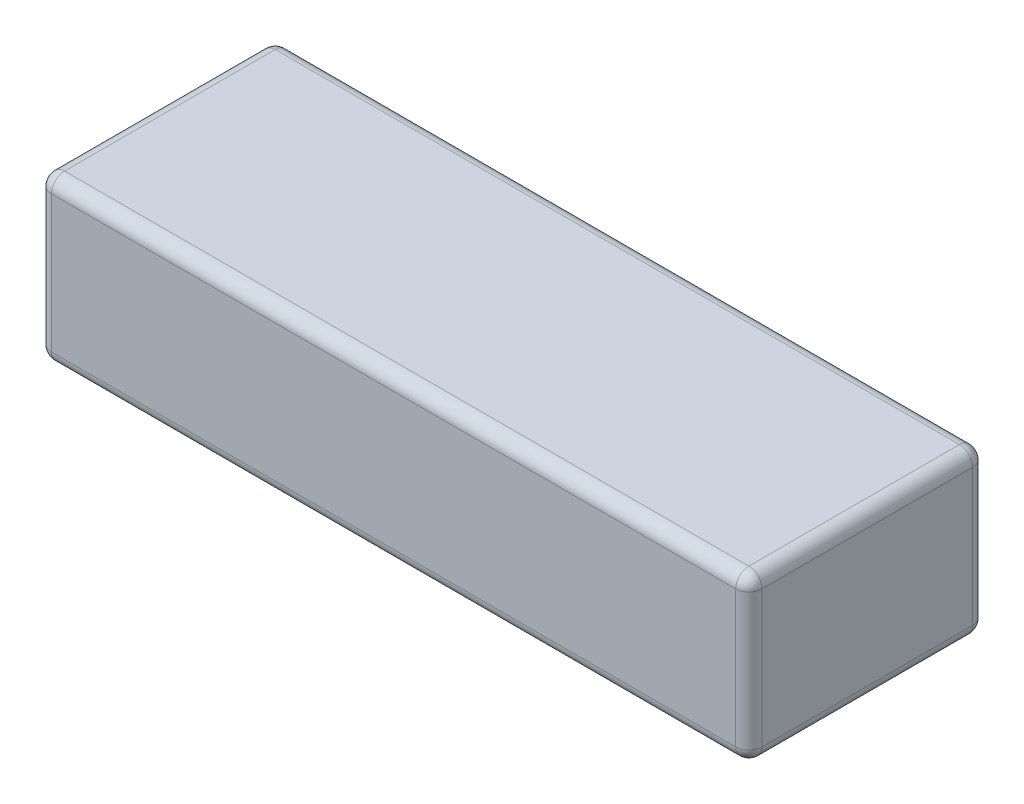
ISO-10303-21;
HEADER;
FILE_DESCRIPTION(('STEP AP214'),'2;1');
FILE_NAME('part.step','',(''),(''),'','','');
FILE_SCHEMA(('AUTOMOTIVE_DESIGN { 1 0 10303 214 1 1 1 1 }'));
ENDSEC;
DATA;
#1=APPLICATION_CONTEXT('core data for automotive mechanical design processes');
#2=APPLICATION_PROTOCOL_DEFINITION('international standard','automotive_design',2000,#1);
#3=PRODUCT_CONTEXT('',#1,'mechanical');
#4=PRODUCT('Part','Part','',(#3));
#5=PRODUCT_RELATED_PRODUCT_CATEGORY('part','',(#4));
#6=PRODUCT_DEFINITION_FORMATION('','',#4);
#7=PRODUCT_DEFINITION_CONTEXT('part definition',#1,'design');
#8=PRODUCT_DEFINITION('design','',#6,#7);
#9=PRODUCT_DEFINITION_SHAPE('','',#8);
#10=(LENGTH_UNIT() NAMED_UNIT(*) SI_UNIT(.MILLI.,.METRE.));
#11=(NAMED_UNIT(*) PLANE_ANGLE_UNIT() SI_UNIT($,.RADIAN.));
#12=(NAMED_UNIT(*) SI_UNIT($,.STERADIAN.) SOLID_ANGLE_UNIT());
#13=UNCERTAINTY_MEASURE_WITH_UNIT(LENGTH_MEASURE(1.E-05),#10,'distance_accuracy_value','');
#14=(GEOMETRIC_REPRESENTATION_CONTEXT(3) GLOBAL_UNCERTAINTY_ASSIGNED_CONTEXT((#13)) GLOBAL_UNIT_ASSIGNED_CONTEXT((#10,
#11,#12)) REPRESENTATION_CONTEXT('',''));
#15=CARTESIAN_POINT('',(0.,0.,0.));
#16=DIRECTION('',(0.,0.,1.));
#17=DIRECTION('',(1.,0.,0.));
#18=AXIS2_PLACEMENT_3D('',#15,#16,#17);
#19=CARTESIAN_POINT('',(67.5,31.,22.5));
#20=DIRECTION('',(-1.,0.,0.));
#21=DIRECTION('',(0.,0.,1.));
#22=AXIS2_PLACEMENT_3D('',#19,#20,#21);
#23=PLANE('',#22);
#24=DIRECTION('',(0.,-1.,0.));
#25=VECTOR('',#24,1.);
#26=CARTESIAN_POINT('',(67.5,31.,-20.));
#27=LINE('',#26,#25);
#28=CARTESIAN_POINT('',(67.5,2.5,-20.));
#29=VERTEX_POINT('',#28);
#30=CARTESIAN_POINT('',(67.5,28.5,-20.));
#31=VERTEX_POINT('',#30);
#32=EDGE_CURVE('E130',#29,#31,#27,.F.);
#33=ORIENTED_EDGE('',*,*,#32,.T.);
#34=DIRECTION('',(0.,0.,-1.));
#35=VECTOR('',#34,1.);
#36=CARTESIAN_POINT('',(67.5,28.5,22.5));
#37=LINE('',#36,#35);
#38=CARTESIAN_POINT('',(67.5,28.5,20.));
#39=VERTEX_POINT('',#38);
#40=EDGE_CURVE('E167',#31,#39,#37,.F.);
#41=ORIENTED_EDGE('',*,*,#40,.T.);
#42=DIRECTION('',(0.,-1.,0.));
#43=VECTOR('',#42,1.);
#44=CARTESIAN_POINT('',(67.5,31.,20.));
#45=LINE('',#44,#43);
#46=CARTESIAN_POINT('',(67.5,2.5,20.));
#47=VERTEX_POINT('',#46);
#48=EDGE_CURVE('E164',#39,#47,#45,.T.);
#49=ORIENTED_EDGE('',*,*,#48,.T.);
#50=DIRECTION('',(0.,0.,-1.));
#51=VECTOR('',#50,1.);
#52=CARTESIAN_POINT('',(67.5,2.5,-22.5));
#53=LINE('',#52,#51);
#54=EDGE_CURVE('E159',#47,#29,#53,.T.);
#55=ORIENTED_EDGE('',*,*,#54,.T.);
#56=EDGE_LOOP('',(#33,#41,#49,#55));
#57=FACE_BOUND('',#56,.T.);
#58=ADVANCED_FACE('F34',(#57),#23,.F.);
#59=CARTESIAN_POINT('',(-67.5,31.,-22.5));
#60=DIRECTION('',(0.,0.,1.));
#61=DIRECTION('',(1.,0.,0.));
#62=AXIS2_PLACEMENT_3D('',#59,#60,#61);
#63=PLANE('',#62);
#64=DIRECTION('',(0.,-1.,0.));
#65=VECTOR('',#64,1.);
#66=CARTESIAN_POINT('',(-65.,31.,-22.5));
#67=LINE('',#66,#65);
#68=CARTESIAN_POINT('',(-65.,2.5,-22.5));
#69=VERTEX_POINT('',#68);
#70=CARTESIAN_POINT('',(-65.,28.5,-22.5));
#71=VERTEX_POINT('',#70);
#72=EDGE_CURVE('E152',#69,#71,#67,.F.);
#73=ORIENTED_EDGE('',*,*,#72,.T.);
#74=DIRECTION('',(-1.,0.,0.));
#75=VECTOR('',#74,1.);
#76=CARTESIAN_POINT('',(-67.5,28.5,-22.5));
#77=LINE('',#76,#75);
#78=CARTESIAN_POINT('',(65.,28.5,-22.5));
#79=VERTEX_POINT('',#78);
#80=EDGE_CURVE('E156',#71,#79,#77,.F.);
#81=ORIENTED_EDGE('',*,*,#80,.T.);
#82=DIRECTION('',(0.,-1.,0.));
#83=VECTOR('',#82,1.);
#84=CARTESIAN_POINT('',(65.,31.,-22.5));
#85=LINE('',#84,#83);
#86=CARTESIAN_POINT('',(65.,2.5,-22.5));
#87=VERTEX_POINT('',#86);
#88=EDGE_CURVE('E128',#79,#87,#85,.T.);
#89=ORIENTED_EDGE('',*,*,#88,.T.);
#90=DIRECTION('',(-1.,0.,0.));
#91=VECTOR('',#90,1.);
#92=CARTESIAN_POINT('',(-67.5,2.5,-22.5));
#93=LINE('',#92,#91);
#94=EDGE_CURVE('E146',#87,#69,#93,.T.);
#95=ORIENTED_EDGE('',*,*,#94,.T.);
#96=EDGE_LOOP('',(#73,#81,#89,#95));
#97=FACE_BOUND('',#96,.T.);
#98=ADVANCED_FACE('F154',(#97),#63,.F.);
#99=CARTESIAN_POINT('',(-67.5,31.,22.5));
#100=DIRECTION('',(1.,0.,0.));
#101=DIRECTION('',(0.,0.,-1.));
#102=AXIS2_PLACEMENT_3D('',#99,#100,#101);
#103=PLANE('',#102);
#104=DIRECTION('',(0.,-1.,0.));
#105=VECTOR('',#104,1.);
#106=CARTESIAN_POINT('',(-67.5,31.,20.));
#107=LINE('',#106,#105);
#108=CARTESIAN_POINT('',(-67.5,2.5,20.));
#109=VERTEX_POINT('',#108);
#110=CARTESIAN_POINT('',(-67.5,28.5,20.));
#111=VERTEX_POINT('',#110);
#112=EDGE_CURVE('E171',#109,#111,#107,.F.);
#113=ORIENTED_EDGE('',*,*,#112,.T.);
#114=DIRECTION('',(0.,0.,1.));
#115=VECTOR('',#114,1.);
#116=CARTESIAN_POINT('',(-67.5,28.5,22.5));
#117=LINE('',#116,#115);
#118=CARTESIAN_POINT('',(-67.5,28.5,-20.));
#119=VERTEX_POINT('',#118);
#120=EDGE_CURVE('E176',#111,#119,#117,.F.);
#121=ORIENTED_EDGE('',*,*,#120,.T.);
#122=DIRECTION('',(0.,-1.,0.));
#123=VECTOR('',#122,1.);
#124=CARTESIAN_POINT('',(-67.5,31.,-20.));
#125=LINE('',#124,#123);
#126=CARTESIAN_POINT('',(-67.5,2.5,-20.));
#127=VERTEX_POINT('',#126);
#128=EDGE_CURVE('E173',#119,#127,#125,.T.);
#129=ORIENTED_EDGE('',*,*,#128,.T.);
#130=DIRECTION('',(0.,0.,1.));
#131=VECTOR('',#130,1.);
#132=CARTESIAN_POINT('',(-67.5,2.5,22.5));
#133=LINE('',#132,#131);
#134=EDGE_CURVE('E169',#127,#109,#133,.T.);
#135=ORIENTED_EDGE('',*,*,#134,.T.);
#136=EDGE_LOOP('',(#113,#121,#129,#135));
#137=FACE_BOUND('',#136,.T.);
#138=ADVANCED_FACE('F281',(#137),#103,.F.);
#139=CARTESIAN_POINT('',(-67.5,31.,22.5));
#140=DIRECTION('',(0.,0.,-1.));
#141=DIRECTION('',(-1.,0.,0.));
#142=AXIS2_PLACEMENT_3D('',#139,#140,#141);
#143=PLANE('',#142);
#144=DIRECTION('',(0.,-1.,0.));
#145=VECTOR('',#144,1.);
#146=CARTESIAN_POINT('',(65.,31.,22.5));
#147=LINE('',#146,#145);
#148=CARTESIAN_POINT('',(65.,2.5,22.5));
#149=VERTEX_POINT('',#148);
#150=CARTESIAN_POINT('',(65.,28.5,22.5));
#151=VERTEX_POINT('',#150);
#152=EDGE_CURVE('E180',#149,#151,#147,.F.);
#153=ORIENTED_EDGE('',*,*,#152,.T.);
#154=DIRECTION('',(1.,0.,0.));
#155=VECTOR('',#154,1.);
#156=CARTESIAN_POINT('',(-67.5,28.5,22.5));
#157=LINE('',#156,#155);
#158=CARTESIAN_POINT('',(-65.,28.5,22.5));
#159=VERTEX_POINT('',#158);
#160=EDGE_CURVE('E185',#151,#159,#157,.F.);
#161=ORIENTED_EDGE('',*,*,#160,.T.);
#162=DIRECTION('',(0.,-1.,0.));
#163=VECTOR('',#162,1.);
#164=CARTESIAN_POINT('',(-65.,31.,22.5));
#165=LINE('',#164,#163);
#166=CARTESIAN_POINT('',(-65.,2.5,22.5));
#167=VERTEX_POINT('',#166);
#168=EDGE_CURVE('E182',#159,#167,#165,.T.);
#169=ORIENTED_EDGE('',*,*,#168,.T.);
#170=DIRECTION('',(1.,0.,0.));
#171=VECTOR('',#170,1.);
#172=CARTESIAN_POINT('',(67.5,2.5,22.5));
#173=LINE('',#172,#171);
#174=EDGE_CURVE('E178',#167,#149,#173,.T.);
#175=ORIENTED_EDGE('',*,*,#174,.T.);
#176=EDGE_LOOP('',(#153,#161,#169,#175));
#177=FACE_BOUND('',#176,.T.);
#178=ADVANCED_FACE('F292',(#177),#143,.F.);
#179=CARTESIAN_POINT('',(0.,31.,0.));
#180=DIRECTION('',(0.,-1.,0.));
#181=DIRECTION('',(0.,0.,-1.));
#182=AXIS2_PLACEMENT_3D('',#179,#180,#181);
#183=PLANE('',#182);
#184=DIRECTION('',(0.,0.,1.));
#185=VECTOR('',#184,1.);
#186=CARTESIAN_POINT('',(-65.,31.,0.));
#187=LINE('',#186,#185);
#188=CARTESIAN_POINT('',(-65.,31.,-20.));
#189=VERTEX_POINT('',#188);
#190=CARTESIAN_POINT('',(-65.,31.,20.));
#191=VERTEX_POINT('',#190);
#192=EDGE_CURVE('E191',#189,#191,#187,.T.);
#193=ORIENTED_EDGE('',*,*,#192,.T.);
#194=DIRECTION('',(1.,0.,0.));
#195=VECTOR('',#194,1.);
#196=CARTESIAN_POINT('',(0.,31.,20.));
#197=LINE('',#196,#195);
#198=CARTESIAN_POINT('',(65.,31.,20.));
#199=VERTEX_POINT('',#198);
#200=EDGE_CURVE('E193',#191,#199,#197,.T.);
#201=ORIENTED_EDGE('',*,*,#200,.T.);
#202=DIRECTION('',(0.,0.,-1.));
#203=VECTOR('',#202,1.);
#204=CARTESIAN_POINT('',(65.,31.,0.));
#205=LINE('',#204,#203);
#206=CARTESIAN_POINT('',(65.,31.,-20.));
#207=VERTEX_POINT('',#206);
#208=EDGE_CURVE('E187',#199,#207,#205,.T.);
#209=ORIENTED_EDGE('',*,*,#208,.T.);
#210=DIRECTION('',(-1.,0.,0.));
#211=VECTOR('',#210,1.);
#212=CARTESIAN_POINT('',(0.,31.,-20.));
#213=LINE('',#212,#211);
#214=EDGE_CURVE('E189',#207,#189,#213,.T.);
#215=ORIENTED_EDGE('',*,*,#214,.T.);
#216=EDGE_LOOP('',(#193,#201,#209,#215));
#217=FACE_BOUND('',#216,.T.);
#218=ADVANCED_FACE('F273',(#217),#183,.F.);
#219=CARTESIAN_POINT('',(0.,0.,0.));
#220=DIRECTION('',(0.,-1.,0.));
#221=DIRECTION('',(0.,0.,-1.));
#222=AXIS2_PLACEMENT_3D('',#219,#220,#221);
#223=PLANE('',#222);
#224=DIRECTION('',(0.,0.,1.));
#225=VECTOR('',#224,1.);
#226=CARTESIAN_POINT('',(-65.,0.,-22.5));
#227=LINE('',#226,#225);
#228=CARTESIAN_POINT('',(-65.,0.,20.));
#229=VERTEX_POINT('',#228);
#230=CARTESIAN_POINT('',(-65.,0.,-20.));
#231=VERTEX_POINT('',#230);
#232=EDGE_CURVE('E43',#229,#231,#227,.F.);
#233=ORIENTED_EDGE('',*,*,#232,.T.);
#234=DIRECTION('',(-1.,0.,0.));
#235=VECTOR('',#234,1.);
#236=CARTESIAN_POINT('',(67.5,0.,-20.));
#237=LINE('',#236,#235);
#238=CARTESIAN_POINT('',(65.,0.,-20.));
#239=VERTEX_POINT('',#238);
#240=EDGE_CURVE('E11',#231,#239,#237,.F.);
#241=ORIENTED_EDGE('',*,*,#240,.T.);
#242=DIRECTION('',(0.,0.,-1.));
#243=VECTOR('',#242,1.);
#244=CARTESIAN_POINT('',(65.,0.,22.5));
#245=LINE('',#244,#243);
#246=CARTESIAN_POINT('',(65.,0.,20.));
#247=VERTEX_POINT('',#246);
#248=EDGE_CURVE('E196',#239,#247,#245,.F.);
#249=ORIENTED_EDGE('',*,*,#248,.T.);
#250=DIRECTION('',(1.,0.,0.));
#251=VECTOR('',#250,1.);
#252=CARTESIAN_POINT('',(-67.5,0.,20.));
#253=LINE('',#252,#251);
#254=EDGE_CURVE('E54',#247,#229,#253,.F.);
#255=ORIENTED_EDGE('',*,*,#254,.T.);
#256=EDGE_LOOP('',(#233,#241,#249,#255));
#257=FACE_BOUND('',#256,.T.);
#258=ADVANCED_FACE('F479',(#257),#223,.T.);
#259=CARTESIAN_POINT('',(-65.,31.,20.));
#260=DIRECTION('',(0.,-1.,0.));
#261=DIRECTION('',(0.,0.,-1.));
#262=AXIS2_PLACEMENT_3D('',#259,#260,#261);
#263=CYLINDRICAL_SURFACE('',#262,2.5);
#264=CARTESIAN_POINT('',(-65.,28.5,20.));
#265=DIRECTION('',(0.,1.,0.));
#266=DIRECTION('',(0.,0.,1.));
#267=AXIS2_PLACEMENT_3D('',#264,#265,#266);
#268=CIRCLE('',#267,2.5);
#269=EDGE_CURVE('E38',#111,#159,#268,.T.);
#270=ORIENTED_EDGE('',*,*,#269,.F.);
#271=ORIENTED_EDGE('',*,*,#112,.F.);
#272=CARTESIAN_POINT('',(-65.,2.5,20.));
#273=DIRECTION('',(0.,-1.,0.));
#274=DIRECTION('',(0.,0.,-1.));
#275=AXIS2_PLACEMENT_3D('',#272,#273,#274);
#276=CIRCLE('',#275,2.5);
#277=EDGE_CURVE('E250',#167,#109,#276,.T.);
#278=ORIENTED_EDGE('',*,*,#277,.F.);
#279=ORIENTED_EDGE('',*,*,#168,.F.);
#280=EDGE_LOOP('',(#270,#271,#278,#279));
#281=FACE_BOUND('',#280,.T.);
#282=ADVANCED_FACE('F36',(#281),#263,.T.);
#283=CARTESIAN_POINT('',(-65.,28.5,20.));
#284=DIRECTION('',(0.,0.,1.));
#285=DIRECTION('',(1.,0.,0.));
#286=AXIS2_PLACEMENT_3D('',#283,#284,#285);
#287=SPHERICAL_SURFACE('',#286,2.5);
#288=CARTESIAN_POINT('',(-65.,28.5,20.));
#289=DIRECTION('',(0.,0.,1.));
#290=DIRECTION('',(1.,0.,0.));
#291=AXIS2_PLACEMENT_3D('',#288,#289,#290);
#292=CIRCLE('',#291,2.5);
#293=EDGE_CURVE('E245',#111,#191,#292,.F.);
#294=ORIENTED_EDGE('',*,*,#293,.F.);
#295=ORIENTED_EDGE('',*,*,#269,.T.);
#296=CARTESIAN_POINT('',(-65.,28.5,20.));
#297=DIRECTION('',(-1.,0.,0.));
#298=DIRECTION('',(0.,0.,1.));
#299=AXIS2_PLACEMENT_3D('',#296,#297,#298);
#300=CIRCLE('',#299,2.5);
#301=EDGE_CURVE('E248',#191,#159,#300,.F.);
#302=ORIENTED_EDGE('',*,*,#301,.F.);
#303=EDGE_LOOP('',(#294,#295,#302));
#304=FACE_BOUND('',#303,.T.);
#305=ADVANCED_FACE('F261',(#304),#287,.T.);
#306=CARTESIAN_POINT('',(-65.,2.5,20.));
#307=DIRECTION('',(0.,0.,1.));
#308=DIRECTION('',(1.,0.,0.));
#309=AXIS2_PLACEMENT_3D('',#306,#307,#308);
#310=SPHERICAL_SURFACE('',#309,2.5);
#311=CARTESIAN_POINT('',(-65.,2.5,20.));
#312=DIRECTION('',(-1.,0.,0.));
#313=DIRECTION('',(0.,0.,1.));
#314=AXIS2_PLACEMENT_3D('',#311,#312,#313);
#315=CIRCLE('',#314,2.5);
#316=EDGE_CURVE('E240',#167,#229,#315,.F.);
#317=ORIENTED_EDGE('',*,*,#316,.F.);
#318=ORIENTED_EDGE('',*,*,#277,.T.);
#319=CARTESIAN_POINT('',(-65.,2.5,20.));
#320=DIRECTION('',(0.,0.,1.));
#321=DIRECTION('',(1.,0.,0.));
#322=AXIS2_PLACEMENT_3D('',#319,#320,#321);
#323=CIRCLE('',#322,2.5);
#324=EDGE_CURVE('E242',#229,#109,#323,.F.);
#325=ORIENTED_EDGE('',*,*,#324,.F.);
#326=EDGE_LOOP('',(#317,#318,#325));
#327=FACE_BOUND('',#326,.T.);
#328=ADVANCED_FACE('F458',(#327),#310,.T.);
#329=CARTESIAN_POINT('',(0.,28.5,20.));
#330=DIRECTION('',(1.,0.,0.));
#331=DIRECTION('',(0.,0.,-1.));
#332=AXIS2_PLACEMENT_3D('',#329,#330,#331);
#333=CYLINDRICAL_SURFACE('',#332,2.5);
#334=ORIENTED_EDGE('',*,*,#301,.T.);
#335=ORIENTED_EDGE('',*,*,#160,.F.);
#336=CARTESIAN_POINT('',(65.,28.5,20.));
#337=DIRECTION('',(1.,0.,0.));
#338=DIRECTION('',(0.,0.,-1.));
#339=AXIS2_PLACEMENT_3D('',#336,#337,#338);
#340=CIRCLE('',#339,2.5);
#341=EDGE_CURVE('E234',#199,#151,#340,.T.);
#342=ORIENTED_EDGE('',*,*,#341,.F.);
#343=ORIENTED_EDGE('',*,*,#200,.F.);
#344=EDGE_LOOP('',(#334,#335,#342,#343));
#345=FACE_BOUND('',#344,.T.);
#346=ADVANCED_FACE('F269',(#345),#333,.T.);
#347=CARTESIAN_POINT('',(-65.,28.5,0.));
#348=DIRECTION('',(0.,0.,1.));
#349=DIRECTION('',(1.,0.,0.));
#350=AXIS2_PLACEMENT_3D('',#347,#348,#349);
#351=CYLINDRICAL_SURFACE('',#350,2.5);
#352=ORIENTED_EDGE('',*,*,#293,.T.);
#353=ORIENTED_EDGE('',*,*,#192,.F.);
#354=CARTESIAN_POINT('',(-65.,28.5,-20.));
#355=DIRECTION('',(0.,0.,-1.));
#356=DIRECTION('',(0.,1.,0.));
#357=AXIS2_PLACEMENT_3D('',#354,#355,#356);
#358=CIRCLE('',#357,2.5);
#359=EDGE_CURVE('E231',#119,#189,#358,.T.);
#360=ORIENTED_EDGE('',*,*,#359,.F.);
#361=ORIENTED_EDGE('',*,*,#120,.F.);
#362=EDGE_LOOP('',(#352,#353,#360,#361));
#363=FACE_BOUND('',#362,.T.);
#364=ADVANCED_FACE('F278',(#363),#351,.T.);
#365=CARTESIAN_POINT('',(-65.,31.,-20.));
#366=DIRECTION('',(0.,-1.,0.));
#367=DIRECTION('',(0.,0.,-1.));
#368=AXIS2_PLACEMENT_3D('',#365,#366,#367);
#369=CYLINDRICAL_SURFACE('',#368,2.5);
#370=CARTESIAN_POINT('',(-65.,2.5,-20.));
#371=DIRECTION('',(0.,-1.,0.));
#372=DIRECTION('',(0.,0.,-1.));
#373=AXIS2_PLACEMENT_3D('',#370,#371,#372);
#374=CIRCLE('',#373,2.5);
#375=EDGE_CURVE('E225',#127,#69,#374,.T.);
#376=ORIENTED_EDGE('',*,*,#375,.F.);
#377=ORIENTED_EDGE('',*,*,#128,.F.);
#378=CARTESIAN_POINT('',(-65.,28.5,-20.));
#379=DIRECTION('',(0.,1.,0.));
#380=DIRECTION('',(0.,0.,1.));
#381=AXIS2_PLACEMENT_3D('',#378,#379,#380);
#382=CIRCLE('',#381,2.5);
#383=EDGE_CURVE('E228',#71,#119,#382,.T.);
#384=ORIENTED_EDGE('',*,*,#383,.F.);
#385=ORIENTED_EDGE('',*,*,#72,.F.);
#386=EDGE_LOOP('',(#376,#377,#384,#385));
#387=FACE_BOUND('',#386,.T.);
#388=ADVANCED_FACE('F285',(#387),#369,.T.);
#389=CARTESIAN_POINT('',(-65.,2.5,22.5));
#390=DIRECTION('',(0.,0.,-1.));
#391=DIRECTION('',(-1.,0.,0.));
#392=AXIS2_PLACEMENT_3D('',#389,#390,#391);
#393=CYLINDRICAL_SURFACE('',#392,2.5);
#394=ORIENTED_EDGE('',*,*,#324,.T.);
#395=ORIENTED_EDGE('',*,*,#134,.F.);
#396=CARTESIAN_POINT('',(-65.,2.5,-20.));
#397=DIRECTION('',(0.,0.,-1.));
#398=DIRECTION('',(-1.,0.,0.));
#399=AXIS2_PLACEMENT_3D('',#396,#397,#398);
#400=CIRCLE('',#399,2.5);
#401=EDGE_CURVE('E223',#231,#127,#400,.T.);
#402=ORIENTED_EDGE('',*,*,#401,.F.);
#403=ORIENTED_EDGE('',*,*,#232,.F.);
#404=EDGE_LOOP('',(#394,#395,#402,#403));
#405=FACE_BOUND('',#404,.T.);
#406=ADVANCED_FACE('F290',(#405),#393,.T.);
#407=CARTESIAN_POINT('',(-67.5,2.5,20.));
#408=DIRECTION('',(-1.,0.,0.));
#409=DIRECTION('',(0.,0.,1.));
#410=AXIS2_PLACEMENT_3D('',#407,#408,#409);
#411=CYLINDRICAL_SURFACE('',#410,2.5);
#412=ORIENTED_EDGE('',*,*,#316,.T.);
#413=ORIENTED_EDGE('',*,*,#254,.F.);
#414=CARTESIAN_POINT('',(65.,2.5,20.));
#415=DIRECTION('',(1.,0.,0.));
#416=DIRECTION('',(0.,0.,-1.));
#417=AXIS2_PLACEMENT_3D('',#414,#415,#416);
#418=CIRCLE('',#417,2.5);
#419=EDGE_CURVE('E220',#149,#247,#418,.T.);
#420=ORIENTED_EDGE('',*,*,#419,.F.);
#421=ORIENTED_EDGE('',*,*,#174,.F.);
#422=EDGE_LOOP('',(#412,#413,#420,#421));
#423=FACE_BOUND('',#422,.T.);
#424=ADVANCED_FACE('F301',(#423),#411,.T.);
#425=CARTESIAN_POINT('',(65.,31.,20.));
#426=DIRECTION('',(0.,-1.,0.));
#427=DIRECTION('',(0.,0.,-1.));
#428=AXIS2_PLACEMENT_3D('',#425,#426,#427);
#429=CYLINDRICAL_SURFACE('',#428,2.5);
#430=CARTESIAN_POINT('',(65.,28.5,20.));
#431=DIRECTION('',(0.,1.,0.));
#432=DIRECTION('',(0.,0.,1.));
#433=AXIS2_PLACEMENT_3D('',#430,#431,#432);
#434=CIRCLE('',#433,2.5);
#435=EDGE_CURVE('E237',#151,#39,#434,.T.);
#436=ORIENTED_EDGE('',*,*,#435,.F.);
#437=ORIENTED_EDGE('',*,*,#152,.F.);
#438=CARTESIAN_POINT('',(65.,2.5,20.));
#439=DIRECTION('',(0.,-1.,0.));
#440=DIRECTION('',(0.,0.,-1.));
#441=AXIS2_PLACEMENT_3D('',#438,#439,#440);
#442=CIRCLE('',#441,2.5);
#443=EDGE_CURVE('E217',#47,#149,#442,.T.);
#444=ORIENTED_EDGE('',*,*,#443,.F.);
#445=ORIENTED_EDGE('',*,*,#48,.F.);
#446=EDGE_LOOP('',(#436,#437,#444,#445));
#447=FACE_BOUND('',#446,.T.);
#448=ADVANCED_FACE('F297',(#447),#429,.T.);
#449=CARTESIAN_POINT('',(65.,28.5,20.));
#450=DIRECTION('',(0.,0.,1.));
#451=DIRECTION('',(1.,0.,0.));
#452=AXIS2_PLACEMENT_3D('',#449,#450,#451);
#453=SPHERICAL_SURFACE('',#452,2.5);
#454=ORIENTED_EDGE('',*,*,#341,.T.);
#455=ORIENTED_EDGE('',*,*,#435,.T.);
#456=CARTESIAN_POINT('',(65.,28.5,20.));
#457=DIRECTION('',(0.,0.,1.));
#458=DIRECTION('',(1.,0.,0.));
#459=AXIS2_PLACEMENT_3D('',#456,#457,#458);
#460=CIRCLE('',#459,2.5);
#461=EDGE_CURVE('E214',#199,#39,#460,.F.);
#462=ORIENTED_EDGE('',*,*,#461,.F.);
#463=EDGE_LOOP('',(#454,#455,#462));
#464=FACE_BOUND('',#463,.T.);
#465=ADVANCED_FACE('F311',(#464),#453,.T.);
#466=CARTESIAN_POINT('',(-65.,28.5,-20.));
#467=DIRECTION('',(0.,0.,1.));
#468=DIRECTION('',(1.,0.,0.));
#469=AXIS2_PLACEMENT_3D('',#466,#467,#468);
#470=SPHERICAL_SURFACE('',#469,2.5);
#471=ORIENTED_EDGE('',*,*,#383,.T.);
#472=ORIENTED_EDGE('',*,*,#359,.T.);
#473=CARTESIAN_POINT('',(-65.,28.5,-20.));
#474=DIRECTION('',(-1.,0.,0.));
#475=DIRECTION('',(0.,0.,1.));
#476=AXIS2_PLACEMENT_3D('',#473,#474,#475);
#477=CIRCLE('',#476,2.5);
#478=EDGE_CURVE('E211',#71,#189,#477,.F.);
#479=ORIENTED_EDGE('',*,*,#478,.F.);
#480=EDGE_LOOP('',(#471,#472,#479));
#481=FACE_BOUND('',#480,.T.);
#482=ADVANCED_FACE('F321',(#481),#470,.T.);
#483=CARTESIAN_POINT('',(-65.,2.5,-20.));
#484=DIRECTION('',(0.,0.,1.));
#485=DIRECTION('',(1.,0.,0.));
#486=AXIS2_PLACEMENT_3D('',#483,#484,#485);
#487=SPHERICAL_SURFACE('',#486,2.5);
#488=ORIENTED_EDGE('',*,*,#401,.T.);
#489=ORIENTED_EDGE('',*,*,#375,.T.);
#490=CARTESIAN_POINT('',(-65.,2.5,-20.));
#491=DIRECTION('',(-1.,0.,0.));
#492=DIRECTION('',(0.,0.,1.));
#493=AXIS2_PLACEMENT_3D('',#490,#491,#492);
#494=CIRCLE('',#493,2.5);
#495=EDGE_CURVE('E149',#231,#69,#494,.F.);
#496=ORIENTED_EDGE('',*,*,#495,.F.);
#497=EDGE_LOOP('',(#488,#489,#496));
#498=FACE_BOUND('',#497,.T.);
#499=ADVANCED_FACE('F323',(#498),#487,.T.);
#500=CARTESIAN_POINT('',(65.,2.5,20.));
#501=DIRECTION('',(0.,0.,1.));
#502=DIRECTION('',(1.,0.,0.));
#503=AXIS2_PLACEMENT_3D('',#500,#501,#502);
#504=SPHERICAL_SURFACE('',#503,2.5);
#505=ORIENTED_EDGE('',*,*,#443,.T.);
#506=ORIENTED_EDGE('',*,*,#419,.T.);
#507=CARTESIAN_POINT('',(65.,2.5,20.));
#508=DIRECTION('',(0.,0.,1.));
#509=DIRECTION('',(1.,0.,0.));
#510=AXIS2_PLACEMENT_3D('',#507,#508,#509);
#511=CIRCLE('',#510,2.5);
#512=EDGE_CURVE('E207',#47,#247,#511,.F.);
#513=ORIENTED_EDGE('',*,*,#512,.F.);
#514=EDGE_LOOP('',(#505,#506,#513));
#515=FACE_BOUND('',#514,.T.);
#516=ADVANCED_FACE('F303',(#515),#504,.T.);
#517=CARTESIAN_POINT('',(65.,28.5,0.));
#518=DIRECTION('',(0.,0.,-1.));
#519=DIRECTION('',(-1.,0.,0.));
#520=AXIS2_PLACEMENT_3D('',#517,#518,#519);
#521=CYLINDRICAL_SURFACE('',#520,2.5);
#522=ORIENTED_EDGE('',*,*,#461,.T.);
#523=ORIENTED_EDGE('',*,*,#40,.F.);
#524=CARTESIAN_POINT('',(65.,28.5,-20.));
#525=DIRECTION('',(0.,0.,-1.));
#526=DIRECTION('',(-1.,0.,0.));
#527=AXIS2_PLACEMENT_3D('',#524,#525,#526);
#528=CIRCLE('',#527,2.5);
#529=EDGE_CURVE('E204',#207,#31,#528,.T.);
#530=ORIENTED_EDGE('',*,*,#529,.F.);
#531=ORIENTED_EDGE('',*,*,#208,.F.);
#532=EDGE_LOOP('',(#522,#523,#530,#531));
#533=FACE_BOUND('',#532,.T.);
#534=ADVANCED_FACE('F313',(#533),#521,.T.);
#535=CARTESIAN_POINT('',(0.,28.5,-20.));
#536=DIRECTION('',(-1.,0.,0.));
#537=DIRECTION('',(0.,0.,1.));
#538=AXIS2_PLACEMENT_3D('',#535,#536,#537);
#539=CYLINDRICAL_SURFACE('',#538,2.5);
#540=ORIENTED_EDGE('',*,*,#478,.T.);
#541=ORIENTED_EDGE('',*,*,#214,.F.);
#542=CARTESIAN_POINT('',(65.,28.5,-20.));
#543=DIRECTION('',(1.,0.,0.));
#544=DIRECTION('',(0.,0.,-1.));
#545=AXIS2_PLACEMENT_3D('',#542,#543,#544);
#546=CIRCLE('',#545,2.5);
#547=EDGE_CURVE('E143',#79,#207,#546,.T.);
#548=ORIENTED_EDGE('',*,*,#547,.F.);
#549=ORIENTED_EDGE('',*,*,#80,.F.);
#550=EDGE_LOOP('',(#540,#541,#548,#549));
#551=FACE_BOUND('',#550,.T.);
#552=ADVANCED_FACE('F319',(#551),#539,.T.);
#553=CARTESIAN_POINT('',(-67.5,2.5,-20.));
#554=DIRECTION('',(1.,0.,0.));
#555=DIRECTION('',(0.,0.,-1.));
#556=AXIS2_PLACEMENT_3D('',#553,#554,#555);
#557=CYLINDRICAL_SURFACE('',#556,2.5);
#558=ORIENTED_EDGE('',*,*,#495,.T.);
#559=ORIENTED_EDGE('',*,*,#94,.F.);
#560=CARTESIAN_POINT('',(65.,2.5,-20.));
#561=DIRECTION('',(1.,0.,0.));
#562=DIRECTION('',(0.,0.,-1.));
#563=AXIS2_PLACEMENT_3D('',#560,#561,#562);
#564=CIRCLE('',#563,2.5);
#565=EDGE_CURVE('E135',#239,#87,#564,.T.);
#566=ORIENTED_EDGE('',*,*,#565,.F.);
#567=ORIENTED_EDGE('',*,*,#240,.F.);
#568=EDGE_LOOP('',(#558,#559,#566,#567));
#569=FACE_BOUND('',#568,.T.);
#570=ADVANCED_FACE('F147',(#569),#557,.T.);
#571=CARTESIAN_POINT('',(65.,2.5,22.5));
#572=DIRECTION('',(0.,0.,1.));
#573=DIRECTION('',(1.,0.,0.));
#574=AXIS2_PLACEMENT_3D('',#571,#572,#573);
#575=CYLINDRICAL_SURFACE('',#574,2.5);
#576=ORIENTED_EDGE('',*,*,#512,.T.);
#577=ORIENTED_EDGE('',*,*,#248,.F.);
#578=CARTESIAN_POINT('',(65.,2.5,-20.));
#579=DIRECTION('',(0.,0.,-1.));
#580=DIRECTION('',(-1.,0.,0.));
#581=AXIS2_PLACEMENT_3D('',#578,#579,#580);
#582=CIRCLE('',#581,2.5);
#583=EDGE_CURVE('E139',#29,#239,#582,.T.);
#584=ORIENTED_EDGE('',*,*,#583,.F.);
#585=ORIENTED_EDGE('',*,*,#54,.F.);
#586=EDGE_LOOP('',(#576,#577,#584,#585));
#587=FACE_BOUND('',#586,.T.);
#588=ADVANCED_FACE('F306',(#587),#575,.T.);
#589=CARTESIAN_POINT('',(65.,28.5,-20.));
#590=DIRECTION('',(0.,0.,1.));
#591=DIRECTION('',(1.,0.,0.));
#592=AXIS2_PLACEMENT_3D('',#589,#590,#591);
#593=SPHERICAL_SURFACE('',#592,2.5);
#594=ORIENTED_EDGE('',*,*,#547,.T.);
#595=ORIENTED_EDGE('',*,*,#529,.T.);
#596=CARTESIAN_POINT('',(65.,28.5,-20.));
#597=DIRECTION('',(0.,1.,0.));
#598=DIRECTION('',(0.,0.,1.));
#599=AXIS2_PLACEMENT_3D('',#596,#597,#598);
#600=CIRCLE('',#599,2.5);
#601=EDGE_CURVE('E132',#79,#31,#600,.F.);
#602=ORIENTED_EDGE('',*,*,#601,.F.);
#603=EDGE_LOOP('',(#594,#595,#602));
#604=FACE_BOUND('',#603,.T.);
#605=ADVANCED_FACE('F317',(#604),#593,.T.);
#606=CARTESIAN_POINT('',(65.,2.5,-20.));
#607=DIRECTION('',(0.,0.,1.));
#608=DIRECTION('',(1.,0.,0.));
#609=AXIS2_PLACEMENT_3D('',#606,#607,#608);
#610=SPHERICAL_SURFACE('',#609,2.5);
#611=ORIENTED_EDGE('',*,*,#583,.T.);
#612=ORIENTED_EDGE('',*,*,#565,.T.);
#613=CARTESIAN_POINT('',(65.,2.5,-20.));
#614=DIRECTION('',(0.,-1.,0.));
#615=DIRECTION('',(0.,0.,-1.));
#616=AXIS2_PLACEMENT_3D('',#613,#614,#615);
#617=CIRCLE('',#616,2.5);
#618=EDGE_CURVE('E124',#29,#87,#617,.F.);
#619=ORIENTED_EDGE('',*,*,#618,.F.);
#620=EDGE_LOOP('',(#611,#612,#619));
#621=FACE_BOUND('',#620,.T.);
#622=ADVANCED_FACE('F137',(#621),#610,.T.);
#623=CARTESIAN_POINT('',(65.,31.,-20.));
#624=DIRECTION('',(0.,-1.,0.));
#625=DIRECTION('',(0.,0.,-1.));
#626=AXIS2_PLACEMENT_3D('',#623,#624,#625);
#627=CYLINDRICAL_SURFACE('',#626,2.5);
#628=ORIENTED_EDGE('',*,*,#601,.T.);
#629=ORIENTED_EDGE('',*,*,#32,.F.);
#630=ORIENTED_EDGE('',*,*,#618,.T.);
#631=ORIENTED_EDGE('',*,*,#88,.F.);
#632=EDGE_LOOP('',(#628,#629,#630,#631));
#633=FACE_BOUND('',#632,.T.);
#634=ADVANCED_FACE('F126',(#633),#627,.T.);
#635=CLOSED_SHELL('',(#58,#98,#138,#178,#218,#258,#282,#305,#328,#346,#364,#388,#406,#424,#448,
#465,#482,#499,#516,#534,#552,#570,#588,#605,#622,#634));
#636=MANIFOLD_SOLID_BREP('B2',#635);
#637=ADVANCED_BREP_SHAPE_REPRESENTATION('',(#18,#636),#14);
#638=SHAPE_DEFINITION_REPRESENTATION(#9,#637);
ENDSEC;
END-ISO-10303-21;
